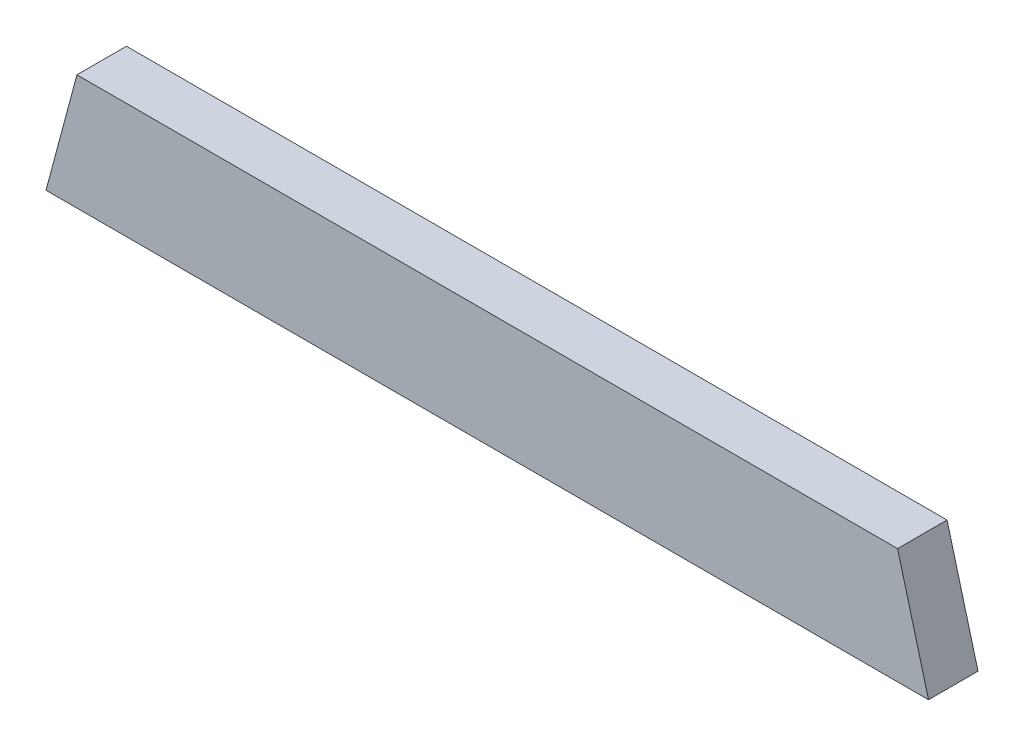
ISO-10303-21;
HEADER;
FILE_DESCRIPTION(('STEP AP214'),'2;1');
FILE_NAME('part.step','',(''),(''),'','','');
FILE_SCHEMA(('AUTOMOTIVE_DESIGN { 1 0 10303 214 1 1 1 1 }'));
ENDSEC;
DATA;
#1=APPLICATION_CONTEXT('core data for automotive mechanical design processes');
#2=APPLICATION_PROTOCOL_DEFINITION('international standard','automotive_design',2000,#1);
#3=PRODUCT_CONTEXT('',#1,'mechanical');
#4=PRODUCT('Part','Part','',(#3));
#5=PRODUCT_RELATED_PRODUCT_CATEGORY('part','',(#4));
#6=PRODUCT_DEFINITION_FORMATION('','',#4);
#7=PRODUCT_DEFINITION_CONTEXT('part definition',#1,'design');
#8=PRODUCT_DEFINITION('design','',#6,#7);
#9=PRODUCT_DEFINITION_SHAPE('','',#8);
#10=(LENGTH_UNIT() NAMED_UNIT(*) SI_UNIT(.MILLI.,.METRE.));
#11=(NAMED_UNIT(*) PLANE_ANGLE_UNIT() SI_UNIT($,.RADIAN.));
#12=(NAMED_UNIT(*) SI_UNIT($,.STERADIAN.) SOLID_ANGLE_UNIT());
#13=UNCERTAINTY_MEASURE_WITH_UNIT(LENGTH_MEASURE(1.E-05),#10,'distance_accuracy_value','');
#14=(GEOMETRIC_REPRESENTATION_CONTEXT(3) GLOBAL_UNCERTAINTY_ASSIGNED_CONTEXT((#13)) GLOBAL_UNIT_ASSIGNED_CONTEXT((#10,
#11,#12)) REPRESENTATION_CONTEXT('',''));
#15=CARTESIAN_POINT('',(0.,0.,0.));
#16=DIRECTION('',(0.,0.,1.));
#17=DIRECTION('',(1.,0.,0.));
#18=AXIS2_PLACEMENT_3D('',#15,#16,#17);
#19=CARTESIAN_POINT('',(315.9125,88.8999999999999,38.1));
#20=DIRECTION('',(0.,-1.,0.));
#21=DIRECTION('',(0.,0.,-1.));
#22=AXIS2_PLACEMENT_3D('',#19,#20,#21);
#23=PLANE('',#22);
#24=DIRECTION('',(-1.,0.,0.));
#25=VECTOR('',#24,1.);
#26=CARTESIAN_POINT('',(315.9125,88.8999999999999,0.));
#27=LINE('',#26,#25);
#28=CARTESIAN_POINT('',(315.9125,88.8999999999999,0.));
#29=VERTEX_POINT('',#28);
#30=CARTESIAN_POINT('',(-315.9125,88.8999999999999,0.));
#31=VERTEX_POINT('',#30);
#32=EDGE_CURVE('E96',#29,#31,#27,.T.);
#33=ORIENTED_EDGE('',*,*,#32,.T.);
#34=DIRECTION('',(0.,0.,-1.));
#35=VECTOR('',#34,1.);
#36=CARTESIAN_POINT('',(-315.9125,88.8999999999999,38.1));
#37=LINE('',#36,#35);
#38=CARTESIAN_POINT('',(-315.9125,88.8999999999999,38.1));
#39=VERTEX_POINT('',#38);
#40=EDGE_CURVE('E11',#39,#31,#37,.T.);
#41=ORIENTED_EDGE('',*,*,#40,.F.);
#42=DIRECTION('',(-1.,0.,0.));
#43=VECTOR('',#42,1.);
#44=CARTESIAN_POINT('',(315.9125,88.8999999999999,38.1));
#45=LINE('',#44,#43);
#46=CARTESIAN_POINT('',(315.9125,88.8999999999999,38.1));
#47=VERTEX_POINT('',#46);
#48=EDGE_CURVE('E84',#47,#39,#45,.T.);
#49=ORIENTED_EDGE('',*,*,#48,.F.);
#50=DIRECTION('',(0.,0.,-1.));
#51=VECTOR('',#50,1.);
#52=CARTESIAN_POINT('',(315.9125,88.8999999999999,38.1));
#53=LINE('',#52,#51);
#54=EDGE_CURVE('E92',#47,#29,#53,.T.);
#55=ORIENTED_EDGE('',*,*,#54,.T.);
#56=EDGE_LOOP('',(#33,#41,#49,#55));
#57=FACE_BOUND('',#56,.T.);
#58=ADVANCED_FACE('F33',(#57),#23,.F.);
#59=CARTESIAN_POINT('',(-315.9125,88.8999999999999,38.1));
#60=DIRECTION('',(0.965925826289069,-0.258819045102518,0.));
#61=DIRECTION('',(0.258819045102518,0.965925826289069,0.));
#62=AXIS2_PLACEMENT_3D('',#59,#60,#61);
#63=PLANE('',#62);
#64=DIRECTION('',(-0.258819045102518,-0.965925826289069,0.));
#65=VECTOR('',#64,1.);
#66=CARTESIAN_POINT('',(-315.9125,88.8999999999999,0.));
#67=LINE('',#66,#65);
#68=CARTESIAN_POINT('',(-339.733183207127,0.,0.));
#69=VERTEX_POINT('',#68);
#70=EDGE_CURVE('E88',#31,#69,#67,.T.);
#71=ORIENTED_EDGE('',*,*,#70,.T.);
#72=DIRECTION('',(0.,0.,-1.));
#73=VECTOR('',#72,1.);
#74=CARTESIAN_POINT('',(-339.733183207127,0.,38.1));
#75=LINE('',#74,#73);
#76=CARTESIAN_POINT('',(-339.733183207127,0.,38.1));
#77=VERTEX_POINT('',#76);
#78=EDGE_CURVE('E41',#77,#69,#75,.T.);
#79=ORIENTED_EDGE('',*,*,#78,.F.);
#80=DIRECTION('',(-0.258819045102518,-0.965925826289069,0.));
#81=VECTOR('',#80,1.);
#82=CARTESIAN_POINT('',(-315.9125,88.8999999999999,38.1));
#83=LINE('',#82,#81);
#84=EDGE_CURVE('E79',#39,#77,#83,.T.);
#85=ORIENTED_EDGE('',*,*,#84,.F.);
#86=ORIENTED_EDGE('',*,*,#40,.T.);
#87=EDGE_LOOP('',(#71,#79,#85,#86));
#88=FACE_BOUND('',#87,.T.);
#89=ADVANCED_FACE('F87',(#88),#63,.F.);
#90=CARTESIAN_POINT('',(-339.733183207127,0.,38.1));
#91=DIRECTION('',(0.,1.,0.));
#92=DIRECTION('',(0.,0.,1.));
#93=AXIS2_PLACEMENT_3D('',#90,#91,#92);
#94=PLANE('',#93);
#95=DIRECTION('',(1.,0.,0.));
#96=VECTOR('',#95,1.);
#97=CARTESIAN_POINT('',(-339.733183207127,0.,0.));
#98=LINE('',#97,#96);
#99=CARTESIAN_POINT('',(339.733183207127,0.,0.));
#100=VERTEX_POINT('',#99);
#101=EDGE_CURVE('E66',#69,#100,#98,.T.);
#102=ORIENTED_EDGE('',*,*,#101,.T.);
#103=DIRECTION('',(0.,0.,-1.));
#104=VECTOR('',#103,1.);
#105=CARTESIAN_POINT('',(339.733183207127,0.,38.1));
#106=LINE('',#105,#104);
#107=CARTESIAN_POINT('',(339.733183207127,0.,38.1));
#108=VERTEX_POINT('',#107);
#109=EDGE_CURVE('E89',#108,#100,#106,.T.);
#110=ORIENTED_EDGE('',*,*,#109,.F.);
#111=DIRECTION('',(1.,0.,0.));
#112=VECTOR('',#111,1.);
#113=CARTESIAN_POINT('',(-339.733183207127,0.,38.1));
#114=LINE('',#113,#112);
#115=EDGE_CURVE('E82',#77,#108,#114,.T.);
#116=ORIENTED_EDGE('',*,*,#115,.F.);
#117=ORIENTED_EDGE('',*,*,#78,.T.);
#118=EDGE_LOOP('',(#102,#110,#116,#117));
#119=FACE_BOUND('',#118,.T.);
#120=ADVANCED_FACE('F90',(#119),#94,.F.);
#121=CARTESIAN_POINT('',(339.733183207127,0.,38.1));
#122=DIRECTION('',(-0.965925826289069,-0.258819045102518,0.));
#123=DIRECTION('',(0.258819045102518,-0.965925826289069,0.));
#124=AXIS2_PLACEMENT_3D('',#121,#122,#123);
#125=PLANE('',#124);
#126=DIRECTION('',(-0.258819045102518,0.965925826289069,0.));
#127=VECTOR('',#126,1.);
#128=CARTESIAN_POINT('',(339.733183207127,0.,0.));
#129=LINE('',#128,#127);
#130=EDGE_CURVE('E72',#100,#29,#129,.T.);
#131=ORIENTED_EDGE('',*,*,#130,.T.);
#132=ORIENTED_EDGE('',*,*,#54,.F.);
#133=DIRECTION('',(-0.258819045102518,0.965925826289069,0.));
#134=VECTOR('',#133,1.);
#135=CARTESIAN_POINT('',(339.733183207127,0.,38.1));
#136=LINE('',#135,#134);
#137=EDGE_CURVE('E49',#108,#47,#136,.T.);
#138=ORIENTED_EDGE('',*,*,#137,.F.);
#139=ORIENTED_EDGE('',*,*,#109,.T.);
#140=EDGE_LOOP('',(#131,#132,#138,#139));
#141=FACE_BOUND('',#140,.T.);
#142=ADVANCED_FACE('F103',(#141),#125,.F.);
#143=CARTESIAN_POINT('',(0.,0.,38.1));
#144=DIRECTION('',(0.,0.,1.));
#145=DIRECTION('',(1.,0.,0.));
#146=AXIS2_PLACEMENT_3D('',#143,#144,#145);
#147=PLANE('',#146);
#148=ORIENTED_EDGE('',*,*,#48,.T.);
#149=ORIENTED_EDGE('',*,*,#84,.T.);
#150=ORIENTED_EDGE('',*,*,#115,.T.);
#151=ORIENTED_EDGE('',*,*,#137,.T.);
#152=EDGE_LOOP('',(#148,#149,#150,#151));
#153=FACE_BOUND('',#152,.T.);
#154=ADVANCED_FACE('F80',(#153),#147,.T.);
#155=CARTESIAN_POINT('',(0.,0.,0.));
#156=DIRECTION('',(0.,0.,1.));
#157=DIRECTION('',(1.,0.,0.));
#158=AXIS2_PLACEMENT_3D('',#155,#156,#157);
#159=PLANE('',#158);
#160=ORIENTED_EDGE('',*,*,#32,.F.);
#161=ORIENTED_EDGE('',*,*,#130,.F.);
#162=ORIENTED_EDGE('',*,*,#101,.F.);
#163=ORIENTED_EDGE('',*,*,#70,.F.);
#164=EDGE_LOOP('',(#160,#161,#162,#163));
#165=FACE_BOUND('',#164,.T.);
#166=ADVANCED_FACE('F106',(#165),#159,.F.);
#167=CLOSED_SHELL('',(#58,#89,#120,#142,#154,#166));
#168=MANIFOLD_SOLID_BREP('B2',#167);
#169=ADVANCED_BREP_SHAPE_REPRESENTATION('',(#18,#168),#14);
#170=SHAPE_DEFINITION_REPRESENTATION(#9,#169);
ENDSEC;
END-ISO-10303-21;
